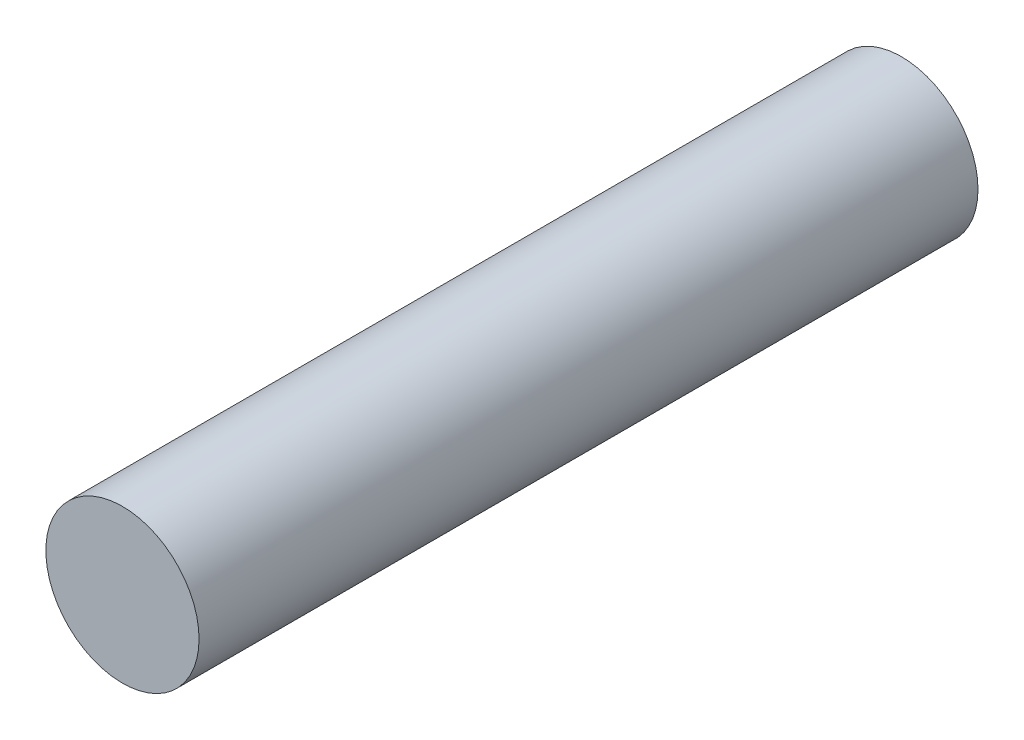
ISO-10303-21;
HEADER;
FILE_DESCRIPTION(('STEP AP214'),'2;1');
FILE_NAME('part.step','',(''),(''),'','','');
FILE_SCHEMA(('AUTOMOTIVE_DESIGN { 1 0 10303 214 1 1 1 1 }'));
ENDSEC;
DATA;
#1=APPLICATION_CONTEXT('core data for automotive mechanical design processes');
#2=APPLICATION_PROTOCOL_DEFINITION('international standard','automotive_design',2000,#1);
#3=PRODUCT_CONTEXT('',#1,'mechanical');
#4=PRODUCT('Part','Part','',(#3));
#5=PRODUCT_RELATED_PRODUCT_CATEGORY('part','',(#4));
#6=PRODUCT_DEFINITION_FORMATION('','',#4);
#7=PRODUCT_DEFINITION_CONTEXT('part definition',#1,'design');
#8=PRODUCT_DEFINITION('design','',#6,#7);
#9=PRODUCT_DEFINITION_SHAPE('','',#8);
#10=(LENGTH_UNIT() NAMED_UNIT(*) SI_UNIT(.MILLI.,.METRE.));
#11=(NAMED_UNIT(*) PLANE_ANGLE_UNIT() SI_UNIT($,.RADIAN.));
#12=(NAMED_UNIT(*) SI_UNIT($,.STERADIAN.) SOLID_ANGLE_UNIT());
#13=UNCERTAINTY_MEASURE_WITH_UNIT(LENGTH_MEASURE(1.E-05),#10,'distance_accuracy_value','');
#14=(GEOMETRIC_REPRESENTATION_CONTEXT(3) GLOBAL_UNCERTAINTY_ASSIGNED_CONTEXT((#13)) GLOBAL_UNIT_ASSIGNED_CONTEXT((#10,
#11,#12)) REPRESENTATION_CONTEXT('',''));
#15=CARTESIAN_POINT('',(0.,0.,0.));
#16=DIRECTION('',(0.,0.,1.));
#17=DIRECTION('',(1.,0.,0.));
#18=AXIS2_PLACEMENT_3D('',#15,#16,#17);
#19=CARTESIAN_POINT('',(0.,0.,30.));
#20=DIRECTION('',(0.,0.,-1.));
#21=DIRECTION('',(-1.,0.,0.));
#22=AXIS2_PLACEMENT_3D('',#19,#20,#21);
#23=CYLINDRICAL_SURFACE('',#22,2.95);
#24=CARTESIAN_POINT('',(0.,0.,30.));
#25=DIRECTION('',(0.,0.,1.));
#26=DIRECTION('',(1.,0.,0.));
#27=AXIS2_PLACEMENT_3D('',#24,#25,#26);
#28=CIRCLE('',#27,2.95);
#29=CARTESIAN_POINT('',(2.95,0.,30.));
#30=VERTEX_POINT('',#29);
#31=EDGE_CURVE('E11',#30,#30,#28,.T.);
#32=ORIENTED_EDGE('',*,*,#31,.F.);
#33=EDGE_LOOP('',(#32));
#34=FACE_BOUND('',#33,.T.);
#35=CARTESIAN_POINT('',(0.,0.,0.));
#36=DIRECTION('',(0.,0.,1.));
#37=DIRECTION('',(1.,0.,0.));
#38=AXIS2_PLACEMENT_3D('',#35,#36,#37);
#39=CIRCLE('',#38,2.95);
#40=CARTESIAN_POINT('',(2.95,0.,0.));
#41=VERTEX_POINT('',#40);
#42=EDGE_CURVE('E36',#41,#41,#39,.T.);
#43=ORIENTED_EDGE('',*,*,#42,.T.);
#44=EDGE_LOOP('',(#43));
#45=FACE_BOUND('',#44,.T.);
#46=ADVANCED_FACE('F33',(#34,#45),#23,.T.);
#47=CARTESIAN_POINT('',(0.,0.,30.));
#48=DIRECTION('',(0.,0.,1.));
#49=DIRECTION('',(1.,0.,0.));
#50=AXIS2_PLACEMENT_3D('',#47,#48,#49);
#51=PLANE('',#50);
#52=ORIENTED_EDGE('',*,*,#31,.T.);
#53=EDGE_LOOP('',(#52));
#54=FACE_BOUND('',#53,.T.);
#55=ADVANCED_FACE('F86',(#54),#51,.T.);
#56=CARTESIAN_POINT('',(0.,0.,0.));
#57=DIRECTION('',(0.,0.,1.));
#58=DIRECTION('',(1.,0.,0.));
#59=AXIS2_PLACEMENT_3D('',#56,#57,#58);
#60=PLANE('',#59);
#61=DIRECTION('',(1.,0.,0.));
#62=VECTOR('',#61,1.);
#63=CARTESIAN_POINT('',(1.34969440985728,1.435,0.));
#64=LINE('',#63,#62);
#65=CARTESIAN_POINT('',(-1.34969440985728,1.435,0.));
#66=VERTEX_POINT('',#65);
#67=CARTESIAN_POINT('',(1.34969440985728,1.435,0.));
#68=VERTEX_POINT('',#67);
#69=EDGE_CURVE('E66',#66,#68,#64,.T.);
#70=ORIENTED_EDGE('',*,*,#69,.F.);
#71=CARTESIAN_POINT('',(0.,0.,0.));
#72=DIRECTION('',(0.,0.,-1.));
#73=DIRECTION('',(-1.,0.,0.));
#74=AXIS2_PLACEMENT_3D('',#71,#72,#73);
#75=CIRCLE('',#74,1.97);
#76=EDGE_CURVE('E47',#68,#66,#75,.T.);
#77=ORIENTED_EDGE('',*,*,#76,.F.);
#78=EDGE_LOOP('',(#70,#77));
#79=FACE_BOUND('',#78,.T.);
#80=ORIENTED_EDGE('',*,*,#42,.F.);
#81=EDGE_LOOP('',(#80));
#82=FACE_BOUND('',#81,.T.);
#83=ADVANCED_FACE('F70',(#79,#82),#60,.F.);
#84=CARTESIAN_POINT('',(0.,0.,7.));
#85=DIRECTION('',(0.,0.,-1.));
#86=DIRECTION('',(-1.,0.,0.));
#87=AXIS2_PLACEMENT_3D('',#84,#85,#86);
#88=CYLINDRICAL_SURFACE('',#87,1.97);
#89=ORIENTED_EDGE('',*,*,#76,.T.);
#90=DIRECTION('',(0.,0.,-1.));
#91=VECTOR('',#90,1.);
#92=CARTESIAN_POINT('',(-1.34969440985728,1.435,7.));
#93=LINE('',#92,#91);
#94=CARTESIAN_POINT('',(-1.34969440985728,1.435,7.));
#95=VERTEX_POINT('',#94);
#96=EDGE_CURVE('E63',#95,#66,#93,.T.);
#97=ORIENTED_EDGE('',*,*,#96,.F.);
#98=CARTESIAN_POINT('',(0.,0.,7.));
#99=DIRECTION('',(0.,0.,-1.));
#100=DIRECTION('',(-1.,0.,0.));
#101=AXIS2_PLACEMENT_3D('',#98,#99,#100);
#102=CIRCLE('',#101,1.97);
#103=CARTESIAN_POINT('',(1.34969440985728,1.435,7.));
#104=VERTEX_POINT('',#103);
#105=EDGE_CURVE('E61',#104,#95,#102,.T.);
#106=ORIENTED_EDGE('',*,*,#105,.F.);
#107=DIRECTION('',(0.,0.,-1.));
#108=VECTOR('',#107,1.);
#109=CARTESIAN_POINT('',(1.34969440985728,1.435,7.));
#110=LINE('',#109,#108);
#111=EDGE_CURVE('E55',#104,#68,#110,.T.);
#112=ORIENTED_EDGE('',*,*,#111,.T.);
#113=EDGE_LOOP('',(#89,#97,#106,#112));
#114=FACE_BOUND('',#113,.T.);
#115=ADVANCED_FACE('F59',(#114),#88,.F.);
#116=CARTESIAN_POINT('',(1.34969440985728,1.435,7.));
#117=DIRECTION('',(0.,1.,0.));
#118=DIRECTION('',(0.,0.,1.));
#119=AXIS2_PLACEMENT_3D('',#116,#117,#118);
#120=PLANE('',#119);
#121=ORIENTED_EDGE('',*,*,#69,.T.);
#122=ORIENTED_EDGE('',*,*,#111,.F.);
#123=DIRECTION('',(1.,0.,0.));
#124=VECTOR('',#123,1.);
#125=CARTESIAN_POINT('',(1.34969440985728,1.435,7.));
#126=LINE('',#125,#124);
#127=EDGE_CURVE('E74',#95,#104,#126,.T.);
#128=ORIENTED_EDGE('',*,*,#127,.F.);
#129=ORIENTED_EDGE('',*,*,#96,.T.);
#130=EDGE_LOOP('',(#121,#122,#128,#129));
#131=FACE_BOUND('',#130,.T.);
#132=ADVANCED_FACE('F67',(#131),#120,.F.);
#133=CARTESIAN_POINT('',(0.,0.,7.));
#134=DIRECTION('',(0.,0.,-1.));
#135=DIRECTION('',(-1.,0.,0.));
#136=AXIS2_PLACEMENT_3D('',#133,#134,#135);
#137=PLANE('',#136);
#138=ORIENTED_EDGE('',*,*,#105,.T.);
#139=ORIENTED_EDGE('',*,*,#127,.T.);
#140=EDGE_LOOP('',(#138,#139));
#141=FACE_BOUND('',#140,.T.);
#142=ADVANCED_FACE('F78',(#141),#137,.T.);
#143=CLOSED_SHELL('',(#46,#55,#83,#115,#132,#142));
#144=MANIFOLD_SOLID_BREP('B2',#143);
#145=ADVANCED_BREP_SHAPE_REPRESENTATION('',(#18,#144),#14);
#146=SHAPE_DEFINITION_REPRESENTATION(#9,#145);
ENDSEC;
END-ISO-10303-21;
